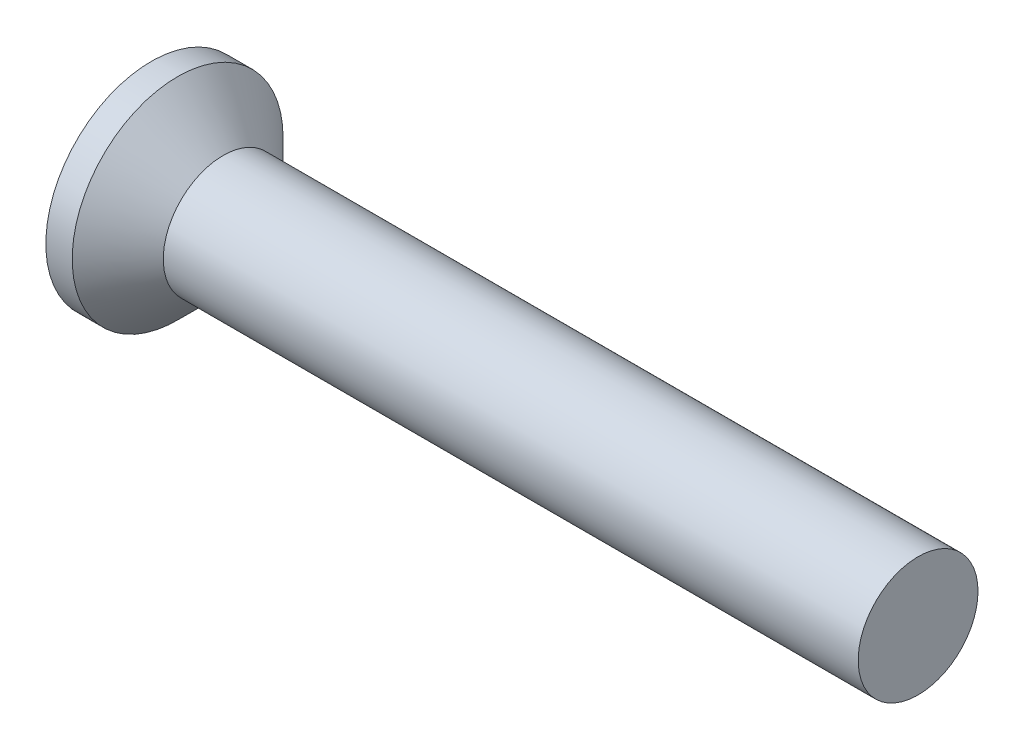
ISO-10303-21;
HEADER;
FILE_DESCRIPTION(('STEP AP214'),'2;1');
FILE_NAME('part.step','',(''),(''),'','','');
FILE_SCHEMA(('AUTOMOTIVE_DESIGN { 1 0 10303 214 1 1 1 1 }'));
ENDSEC;
DATA;
#1=APPLICATION_CONTEXT('core data for automotive mechanical design processes');
#2=APPLICATION_PROTOCOL_DEFINITION('international standard','automotive_design',2000,#1);
#3=PRODUCT_CONTEXT('',#1,'mechanical');
#4=PRODUCT('Part','Part','',(#3));
#5=PRODUCT_RELATED_PRODUCT_CATEGORY('part','',(#4));
#6=PRODUCT_DEFINITION_FORMATION('','',#4);
#7=PRODUCT_DEFINITION_CONTEXT('part definition',#1,'design');
#8=PRODUCT_DEFINITION('design','',#6,#7);
#9=PRODUCT_DEFINITION_SHAPE('','',#8);
#10=(LENGTH_UNIT() NAMED_UNIT(*) SI_UNIT(.MILLI.,.METRE.));
#11=(NAMED_UNIT(*) PLANE_ANGLE_UNIT() SI_UNIT($,.RADIAN.));
#12=(NAMED_UNIT(*) SI_UNIT($,.STERADIAN.) SOLID_ANGLE_UNIT());
#13=UNCERTAINTY_MEASURE_WITH_UNIT(LENGTH_MEASURE(1.E-05),#10,'distance_accuracy_value','');
#14=(GEOMETRIC_REPRESENTATION_CONTEXT(3) GLOBAL_UNCERTAINTY_ASSIGNED_CONTEXT((#13)) GLOBAL_UNIT_ASSIGNED_CONTEXT((#10,
#11,#12)) REPRESENTATION_CONTEXT('',''));
#15=CARTESIAN_POINT('',(0.,0.,0.));
#16=DIRECTION('',(0.,0.,1.));
#17=DIRECTION('',(1.,0.,0.));
#18=AXIS2_PLACEMENT_3D('',#15,#16,#17);
#19=CARTESIAN_POINT('',(0.,2.19999999999999,0.));
#20=DIRECTION('',(-1.,0.,0.));
#21=DIRECTION('',(0.,0.,1.));
#22=AXIS2_PLACEMENT_3D('',#19,#20,#21);
#23=PLANE('',#22);
#24=CARTESIAN_POINT('',(0.,0.,0.));
#25=DIRECTION('',(1.,0.,0.));
#26=DIRECTION('',(0.,0.,-1.));
#27=AXIS2_PLACEMENT_3D('',#24,#25,#26);
#28=CIRCLE('',#27,2.19999999999999);
#29=CARTESIAN_POINT('',(0.,0.,-2.19999999999999));
#30=VERTEX_POINT('',#29);
#31=EDGE_CURVE('E184',#30,#30,#28,.T.);
#32=ORIENTED_EDGE('',*,*,#31,.F.);
#33=EDGE_LOOP('',(#32));
#34=FACE_BOUND('',#33,.T.);
#35=DIRECTION('',(0.,1.,0.));
#36=VECTOR('',#35,1.);
#37=CARTESIAN_POINT('',(0.,-0.29,-0.29));
#38=LINE('',#37,#36);
#39=CARTESIAN_POINT('',(0.,-1.45,-0.29));
#40=VERTEX_POINT('',#39);
#41=CARTESIAN_POINT('',(0.,-0.59,-0.29));
#42=VERTEX_POINT('',#41);
#43=EDGE_CURVE('E288',#40,#42,#38,.T.);
#44=ORIENTED_EDGE('',*,*,#43,.T.);
#45=CARTESIAN_POINT('',(0.,-0.59,-0.59));
#46=DIRECTION('',(-1.,0.,0.));
#47=DIRECTION('',(0.,0.,1.));
#48=AXIS2_PLACEMENT_3D('',#45,#46,#47);
#49=CIRCLE('',#48,0.3);
#50=CARTESIAN_POINT('',(0.,-0.29,-0.59));
#51=VERTEX_POINT('',#50);
#52=EDGE_CURVE('E190',#42,#51,#49,.T.);
#53=ORIENTED_EDGE('',*,*,#52,.T.);
#54=DIRECTION('',(0.,0.,-1.));
#55=VECTOR('',#54,1.);
#56=CARTESIAN_POINT('',(0.,-0.29,-0.29));
#57=LINE('',#56,#55);
#58=CARTESIAN_POINT('',(0.,-0.29,-1.45));
#59=VERTEX_POINT('',#58);
#60=EDGE_CURVE('E283',#51,#59,#57,.T.);
#61=ORIENTED_EDGE('',*,*,#60,.T.);
#62=DIRECTION('',(0.,1.,0.));
#63=VECTOR('',#62,1.);
#64=CARTESIAN_POINT('',(0.,0.29,-1.45));
#65=LINE('',#64,#63);
#66=CARTESIAN_POINT('',(0.,0.29,-1.45));
#67=VERTEX_POINT('',#66);
#68=EDGE_CURVE('E247',#59,#67,#65,.T.);
#69=ORIENTED_EDGE('',*,*,#68,.T.);
#70=DIRECTION('',(0.,0.,1.));
#71=VECTOR('',#70,1.);
#72=CARTESIAN_POINT('',(0.,0.29,-0.29));
#73=LINE('',#72,#71);
#74=CARTESIAN_POINT('',(0.,0.29,-0.59));
#75=VERTEX_POINT('',#74);
#76=EDGE_CURVE('E237',#67,#75,#73,.T.);
#77=ORIENTED_EDGE('',*,*,#76,.T.);
#78=CARTESIAN_POINT('',(0.,0.59,-0.59));
#79=DIRECTION('',(-1.,0.,0.));
#80=DIRECTION('',(0.,0.,1.));
#81=AXIS2_PLACEMENT_3D('',#78,#79,#80);
#82=CIRCLE('',#81,0.3);
#83=CARTESIAN_POINT('',(0.,0.59,-0.29));
#84=VERTEX_POINT('',#83);
#85=EDGE_CURVE('E186',#75,#84,#82,.T.);
#86=ORIENTED_EDGE('',*,*,#85,.T.);
#87=DIRECTION('',(0.,1.,0.));
#88=VECTOR('',#87,1.);
#89=CARTESIAN_POINT('',(0.,0.29,-0.29));
#90=LINE('',#89,#88);
#91=CARTESIAN_POINT('',(0.,1.45,-0.29));
#92=VERTEX_POINT('',#91);
#93=EDGE_CURVE('E234',#84,#92,#90,.T.);
#94=ORIENTED_EDGE('',*,*,#93,.T.);
#95=DIRECTION('',(0.,0.,1.));
#96=VECTOR('',#95,1.);
#97=CARTESIAN_POINT('',(0.,1.45,-0.29));
#98=LINE('',#97,#96);
#99=CARTESIAN_POINT('',(0.,1.45,0.29));
#100=VERTEX_POINT('',#99);
#101=EDGE_CURVE('E243',#92,#100,#98,.T.);
#102=ORIENTED_EDGE('',*,*,#101,.T.);
#103=DIRECTION('',(0.,-1.,0.));
#104=VECTOR('',#103,1.);
#105=CARTESIAN_POINT('',(0.,0.29,0.29));
#106=LINE('',#105,#104);
#107=CARTESIAN_POINT('',(0.,0.59,0.29));
#108=VERTEX_POINT('',#107);
#109=EDGE_CURVE('E245',#100,#108,#106,.T.);
#110=ORIENTED_EDGE('',*,*,#109,.T.);
#111=CARTESIAN_POINT('',(0.,0.59,0.59));
#112=DIRECTION('',(-1.,0.,0.));
#113=DIRECTION('',(0.,0.,1.));
#114=AXIS2_PLACEMENT_3D('',#111,#112,#113);
#115=CIRCLE('',#114,0.3);
#116=CARTESIAN_POINT('',(0.,0.29,0.59));
#117=VERTEX_POINT('',#116);
#118=EDGE_CURVE('E156',#108,#117,#115,.T.);
#119=ORIENTED_EDGE('',*,*,#118,.T.);
#120=DIRECTION('',(0.,0.,1.));
#121=VECTOR('',#120,1.);
#122=CARTESIAN_POINT('',(0.,0.29,0.29));
#123=LINE('',#122,#121);
#124=CARTESIAN_POINT('',(0.,0.29,1.45));
#125=VERTEX_POINT('',#124);
#126=EDGE_CURVE('E150',#117,#125,#123,.T.);
#127=ORIENTED_EDGE('',*,*,#126,.T.);
#128=DIRECTION('',(0.,-1.,0.));
#129=VECTOR('',#128,1.);
#130=CARTESIAN_POINT('',(0.,0.29,1.45));
#131=LINE('',#130,#129);
#132=CARTESIAN_POINT('',(0.,-0.29,1.45));
#133=VERTEX_POINT('',#132);
#134=EDGE_CURVE('E154',#125,#133,#131,.T.);
#135=ORIENTED_EDGE('',*,*,#134,.T.);
#136=DIRECTION('',(0.,0.,-1.));
#137=VECTOR('',#136,1.);
#138=CARTESIAN_POINT('',(0.,-0.29,0.29));
#139=LINE('',#138,#137);
#140=CARTESIAN_POINT('',(0.,-0.29,0.59));
#141=VERTEX_POINT('',#140);
#142=EDGE_CURVE('E166',#133,#141,#139,.T.);
#143=ORIENTED_EDGE('',*,*,#142,.T.);
#144=CARTESIAN_POINT('',(0.,-0.59,0.59));
#145=DIRECTION('',(-1.,0.,0.));
#146=DIRECTION('',(0.,0.,1.));
#147=AXIS2_PLACEMENT_3D('',#144,#145,#146);
#148=CIRCLE('',#147,0.3);
#149=CARTESIAN_POINT('',(0.,-0.59,0.29));
#150=VERTEX_POINT('',#149);
#151=EDGE_CURVE('E188',#141,#150,#148,.T.);
#152=ORIENTED_EDGE('',*,*,#151,.T.);
#153=DIRECTION('',(0.,-1.,0.));
#154=VECTOR('',#153,1.);
#155=CARTESIAN_POINT('',(0.,-0.29,0.29));
#156=LINE('',#155,#154);
#157=CARTESIAN_POINT('',(0.,-1.45,0.289999999999999));
#158=VERTEX_POINT('',#157);
#159=EDGE_CURVE('E295',#150,#158,#156,.T.);
#160=ORIENTED_EDGE('',*,*,#159,.T.);
#161=DIRECTION('',(0.,0.,-1.));
#162=VECTOR('',#161,1.);
#163=CARTESIAN_POINT('',(0.,-1.45,-0.29));
#164=LINE('',#163,#162);
#165=EDGE_CURVE('E292',#158,#40,#164,.T.);
#166=ORIENTED_EDGE('',*,*,#165,.T.);
#167=EDGE_LOOP('',(#44,#53,#61,#69,#77,#86,#94,#102,#110,#119,#127,#135,#143,#152,#160,#166));
#168=FACE_BOUND('',#167,.T.);
#169=ADVANCED_FACE('F38',(#34,#168),#23,.T.);
#170=CARTESIAN_POINT('',(16.,1.25,0.));
#171=DIRECTION('',(1.,0.,0.));
#172=DIRECTION('',(0.,0.,-1.));
#173=AXIS2_PLACEMENT_3D('',#170,#171,#172);
#174=PLANE('',#173);
#175=CARTESIAN_POINT('',(16.,0.,0.));
#176=DIRECTION('',(1.,0.,0.));
#177=DIRECTION('',(0.,0.,-1.));
#178=AXIS2_PLACEMENT_3D('',#175,#176,#177);
#179=CIRCLE('',#178,1.25);
#180=CARTESIAN_POINT('',(16.,0.,-1.25));
#181=VERTEX_POINT('',#180);
#182=EDGE_CURVE('E171',#181,#181,#179,.T.);
#183=ORIENTED_EDGE('',*,*,#182,.T.);
#184=EDGE_LOOP('',(#183));
#185=FACE_BOUND('',#184,.T.);
#186=ADVANCED_FACE('F344',(#185),#174,.T.);
#187=CARTESIAN_POINT('',(4.51581291088132,0.,0.));
#188=DIRECTION('',(1.,0.,0.));
#189=DIRECTION('',(0.,0.,-1.));
#190=AXIS2_PLACEMENT_3D('',#187,#188,#189);
#191=CYLINDRICAL_SURFACE('',#190,2.19999999999999);
#192=ORIENTED_EDGE('',*,*,#31,.T.);
#193=EDGE_LOOP('',(#192));
#194=FACE_BOUND('',#193,.T.);
#195=CARTESIAN_POINT('',(0.550000000000004,0.,0.));
#196=DIRECTION('',(1.,0.,0.));
#197=DIRECTION('',(0.,0.,-1.));
#198=AXIS2_PLACEMENT_3D('',#195,#196,#197);
#199=CIRCLE('',#198,2.19999999999999);
#200=CARTESIAN_POINT('',(0.550000000000004,0.,-2.19999999999999));
#201=VERTEX_POINT('',#200);
#202=EDGE_CURVE('E254',#201,#201,#199,.T.);
#203=ORIENTED_EDGE('',*,*,#202,.F.);
#204=EDGE_LOOP('',(#203));
#205=FACE_BOUND('',#204,.T.);
#206=ADVANCED_FACE('F350',(#194,#205),#191,.T.);
#207=CARTESIAN_POINT('',(1.5,0.,0.));
#208=DIRECTION('',(-1.,0.,0.));
#209=DIRECTION('',(0.,0.,1.));
#210=AXIS2_PLACEMENT_3D('',#207,#208,#209);
#211=CONICAL_SURFACE('',#210,1.24999999999999,0.78539816339745);
#212=ORIENTED_EDGE('',*,*,#202,.T.);
#213=EDGE_LOOP('',(#212));
#214=FACE_BOUND('',#213,.T.);
#215=CARTESIAN_POINT('',(1.5,0.,0.));
#216=DIRECTION('',(1.,0.,0.));
#217=DIRECTION('',(0.,0.,-1.));
#218=AXIS2_PLACEMENT_3D('',#215,#216,#217);
#219=CIRCLE('',#218,1.24999999999999);
#220=CARTESIAN_POINT('',(1.5,0.,-1.24999999999999));
#221=VERTEX_POINT('',#220);
#222=EDGE_CURVE('E174',#221,#221,#219,.T.);
#223=ORIENTED_EDGE('',*,*,#222,.F.);
#224=EDGE_LOOP('',(#223));
#225=FACE_BOUND('',#224,.T.);
#226=ADVANCED_FACE('F490',(#214,#225),#211,.T.);
#227=CARTESIAN_POINT('',(4.51581291088132,0.,0.));
#228=DIRECTION('',(1.,0.,0.));
#229=DIRECTION('',(0.,0.,-1.));
#230=AXIS2_PLACEMENT_3D('',#227,#228,#229);
#231=CYLINDRICAL_SURFACE('',#230,1.25);
#232=ORIENTED_EDGE('',*,*,#182,.F.);
#233=EDGE_LOOP('',(#232));
#234=FACE_BOUND('',#233,.T.);
#235=ORIENTED_EDGE('',*,*,#222,.T.);
#236=EDGE_LOOP('',(#235));
#237=FACE_BOUND('',#236,.T.);
#238=ADVANCED_FACE('F460',(#234,#237),#231,.T.);
#239=CARTESIAN_POINT('',(0.75,0.29,0.29));
#240=DIRECTION('',(0.,-1.,0.));
#241=DIRECTION('',(0.,0.,-1.));
#242=AXIS2_PLACEMENT_3D('',#239,#240,#241);
#243=PLANE('',#242);
#244=ORIENTED_EDGE('',*,*,#126,.F.);
#245=DIRECTION('',(-1.,0.,0.));
#246=VECTOR('',#245,1.);
#247=CARTESIAN_POINT('',(0.75,0.29,0.59));
#248=LINE('',#247,#246);
#249=CARTESIAN_POINT('',(0.75,0.29,0.59));
#250=VERTEX_POINT('',#249);
#251=EDGE_CURVE('E53',#117,#250,#248,.F.);
#252=ORIENTED_EDGE('',*,*,#251,.T.);
#253=DIRECTION('',(0.,0.,1.));
#254=VECTOR('',#253,1.);
#255=CARTESIAN_POINT('',(0.75,0.29,0.29));
#256=LINE('',#255,#254);
#257=CARTESIAN_POINT('',(0.75,0.29,1.01698729810778));
#258=VERTEX_POINT('',#257);
#259=EDGE_CURVE('E169',#250,#258,#256,.T.);
#260=ORIENTED_EDGE('',*,*,#259,.T.);
#261=DIRECTION('',(-0.866025403784438,0.,0.500000000000001));
#262=VECTOR('',#261,1.);
#263=CARTESIAN_POINT('',(0.,0.29,1.45));
#264=LINE('',#263,#262);
#265=EDGE_CURVE('E162',#258,#125,#264,.T.);
#266=ORIENTED_EDGE('',*,*,#265,.T.);
#267=EDGE_LOOP('',(#244,#252,#260,#266));
#268=FACE_BOUND('',#267,.T.);
#269=ADVANCED_FACE('F168',(#268),#243,.T.);
#270=CARTESIAN_POINT('',(0.,0.29,1.45));
#271=DIRECTION('',(-0.500000000000001,0.,-0.866025403784438));
#272=DIRECTION('',(-0.866025403784438,0.,0.500000000000001));
#273=AXIS2_PLACEMENT_3D('',#270,#271,#272);
#274=PLANE('',#273);
#275=ORIENTED_EDGE('',*,*,#134,.F.);
#276=ORIENTED_EDGE('',*,*,#265,.F.);
#277=DIRECTION('',(0.,-1.,0.));
#278=VECTOR('',#277,1.);
#279=CARTESIAN_POINT('',(0.75,0.29,1.01698729810778));
#280=LINE('',#279,#278);
#281=CARTESIAN_POINT('',(0.75,-0.29,1.01698729810778));
#282=VERTEX_POINT('',#281);
#283=EDGE_CURVE('E180',#258,#282,#280,.T.);
#284=ORIENTED_EDGE('',*,*,#283,.T.);
#285=DIRECTION('',(-0.866025403784438,0.,0.500000000000001));
#286=VECTOR('',#285,1.);
#287=CARTESIAN_POINT('',(1.06479473419497,-0.29,0.835240473580834));
#288=LINE('',#287,#286);
#289=EDGE_CURVE('E164',#282,#133,#288,.T.);
#290=ORIENTED_EDGE('',*,*,#289,.T.);
#291=EDGE_LOOP('',(#275,#276,#284,#290));
#292=FACE_BOUND('',#291,.T.);
#293=ADVANCED_FACE('F161',(#292),#274,.T.);
#294=CARTESIAN_POINT('',(0.75,-0.29,0.29));
#295=DIRECTION('',(0.,1.,0.));
#296=DIRECTION('',(0.,0.,1.));
#297=AXIS2_PLACEMENT_3D('',#294,#295,#296);
#298=PLANE('',#297);
#299=DIRECTION('',(0.,0.,-1.));
#300=VECTOR('',#299,1.);
#301=CARTESIAN_POINT('',(0.75,-0.29,0.29));
#302=LINE('',#301,#300);
#303=CARTESIAN_POINT('',(0.75,-0.29,0.59));
#304=VERTEX_POINT('',#303);
#305=EDGE_CURVE('E304',#282,#304,#302,.T.);
#306=ORIENTED_EDGE('',*,*,#305,.T.);
#307=DIRECTION('',(-1.,0.,0.));
#308=VECTOR('',#307,1.);
#309=CARTESIAN_POINT('',(0.75,-0.29,0.59));
#310=LINE('',#309,#308);
#311=EDGE_CURVE('E194',#304,#141,#310,.T.);
#312=ORIENTED_EDGE('',*,*,#311,.T.);
#313=ORIENTED_EDGE('',*,*,#142,.F.);
#314=ORIENTED_EDGE('',*,*,#289,.F.);
#315=EDGE_LOOP('',(#306,#312,#313,#314));
#316=FACE_BOUND('',#315,.T.);
#317=ADVANCED_FACE('F309',(#316),#298,.T.);
#318=CARTESIAN_POINT('',(0.75,-0.29,0.29));
#319=DIRECTION('',(0.,0.,-1.));
#320=DIRECTION('',(0.,1.,0.));
#321=AXIS2_PLACEMENT_3D('',#318,#319,#320);
#322=PLANE('',#321);
#323=ORIENTED_EDGE('',*,*,#159,.F.);
#324=DIRECTION('',(-1.,0.,0.));
#325=VECTOR('',#324,1.);
#326=CARTESIAN_POINT('',(0.75,-0.59,0.29));
#327=LINE('',#326,#325);
#328=CARTESIAN_POINT('',(0.75,-0.59,0.29));
#329=VERTEX_POINT('',#328);
#330=EDGE_CURVE('E197',#150,#329,#327,.F.);
#331=ORIENTED_EDGE('',*,*,#330,.T.);
#332=DIRECTION('',(0.,-1.,0.));
#333=VECTOR('',#332,1.);
#334=CARTESIAN_POINT('',(0.75,-0.29,0.29));
#335=LINE('',#334,#333);
#336=CARTESIAN_POINT('',(0.75,-1.01698729810778,0.289999999999999));
#337=VERTEX_POINT('',#336);
#338=EDGE_CURVE('E265',#329,#337,#335,.T.);
#339=ORIENTED_EDGE('',*,*,#338,.T.);
#340=DIRECTION('',(-0.866025403784438,-0.500000000000001,0.));
#341=VECTOR('',#340,1.);
#342=CARTESIAN_POINT('',(0.,-1.45,0.289999999999999));
#343=LINE('',#342,#341);
#344=EDGE_CURVE('E176',#337,#158,#343,.T.);
#345=ORIENTED_EDGE('',*,*,#344,.T.);
#346=EDGE_LOOP('',(#323,#331,#339,#345));
#347=FACE_BOUND('',#346,.T.);
#348=ADVANCED_FACE('F319',(#347),#322,.T.);
#349=CARTESIAN_POINT('',(0.,-1.45,-0.29));
#350=DIRECTION('',(-0.500000000000001,0.866025403784438,0.));
#351=DIRECTION('',(-0.866025403784438,-0.500000000000001,0.));
#352=AXIS2_PLACEMENT_3D('',#349,#350,#351);
#353=PLANE('',#352);
#354=ORIENTED_EDGE('',*,*,#165,.F.);
#355=ORIENTED_EDGE('',*,*,#344,.F.);
#356=DIRECTION('',(0.,0.,-1.));
#357=VECTOR('',#356,1.);
#358=CARTESIAN_POINT('',(0.75,-1.01698729810778,-0.29));
#359=LINE('',#358,#357);
#360=CARTESIAN_POINT('',(0.75,-1.01698729810778,-0.29));
#361=VERTEX_POINT('',#360);
#362=EDGE_CURVE('E262',#337,#361,#359,.T.);
#363=ORIENTED_EDGE('',*,*,#362,.T.);
#364=DIRECTION('',(-0.866025403784438,-0.500000000000001,0.));
#365=VECTOR('',#364,1.);
#366=CARTESIAN_POINT('',(1.06479473419497,-0.835240473580834,-0.29));
#367=LINE('',#366,#365);
#368=EDGE_CURVE('E259',#361,#40,#367,.T.);
#369=ORIENTED_EDGE('',*,*,#368,.T.);
#370=EDGE_LOOP('',(#354,#355,#363,#369));
#371=FACE_BOUND('',#370,.T.);
#372=ADVANCED_FACE('F323',(#371),#353,.T.);
#373=CARTESIAN_POINT('',(0.75,-0.29,-0.29));
#374=DIRECTION('',(0.,0.,1.));
#375=DIRECTION('',(1.,0.,0.));
#376=AXIS2_PLACEMENT_3D('',#373,#374,#375);
#377=PLANE('',#376);
#378=DIRECTION('',(0.,1.,0.));
#379=VECTOR('',#378,1.);
#380=CARTESIAN_POINT('',(0.75,-0.29,-0.29));
#381=LINE('',#380,#379);
#382=CARTESIAN_POINT('',(0.75,-0.59,-0.29));
#383=VERTEX_POINT('',#382);
#384=EDGE_CURVE('E264',#361,#383,#381,.T.);
#385=ORIENTED_EDGE('',*,*,#384,.T.);
#386=DIRECTION('',(-1.,0.,0.));
#387=VECTOR('',#386,1.);
#388=CARTESIAN_POINT('',(0.75,-0.59,-0.29));
#389=LINE('',#388,#387);
#390=EDGE_CURVE('E181',#383,#42,#389,.T.);
#391=ORIENTED_EDGE('',*,*,#390,.T.);
#392=ORIENTED_EDGE('',*,*,#43,.F.);
#393=ORIENTED_EDGE('',*,*,#368,.F.);
#394=EDGE_LOOP('',(#385,#391,#392,#393));
#395=FACE_BOUND('',#394,.T.);
#396=ADVANCED_FACE('F327',(#395),#377,.T.);
#397=CARTESIAN_POINT('',(0.75,-0.29,-0.29));
#398=DIRECTION('',(0.,1.,0.));
#399=DIRECTION('',(0.,0.,1.));
#400=AXIS2_PLACEMENT_3D('',#397,#398,#399);
#401=PLANE('',#400);
#402=ORIENTED_EDGE('',*,*,#60,.F.);
#403=DIRECTION('',(-1.,0.,0.));
#404=VECTOR('',#403,1.);
#405=CARTESIAN_POINT('',(0.75,-0.29,-0.59));
#406=LINE('',#405,#404);
#407=CARTESIAN_POINT('',(0.75,-0.29,-0.59));
#408=VERTEX_POINT('',#407);
#409=EDGE_CURVE('E192',#51,#408,#406,.F.);
#410=ORIENTED_EDGE('',*,*,#409,.T.);
#411=DIRECTION('',(0.,0.,-1.));
#412=VECTOR('',#411,1.);
#413=CARTESIAN_POINT('',(0.75,-0.29,-0.29));
#414=LINE('',#413,#412);
#415=CARTESIAN_POINT('',(0.75,-0.29,-1.01698729810778));
#416=VERTEX_POINT('',#415);
#417=EDGE_CURVE('E276',#408,#416,#414,.T.);
#418=ORIENTED_EDGE('',*,*,#417,.T.);
#419=DIRECTION('',(-0.866025403784438,0.,-0.500000000000001));
#420=VECTOR('',#419,1.);
#421=CARTESIAN_POINT('',(0.,-0.29,-1.45));
#422=LINE('',#421,#420);
#423=EDGE_CURVE('E261',#416,#59,#422,.T.);
#424=ORIENTED_EDGE('',*,*,#423,.T.);
#425=EDGE_LOOP('',(#402,#410,#418,#424));
#426=FACE_BOUND('',#425,.T.);
#427=ADVANCED_FACE('F282',(#426),#401,.T.);
#428=CARTESIAN_POINT('',(0.,0.29,-1.45));
#429=DIRECTION('',(-0.500000000000001,0.,0.866025403784438));
#430=DIRECTION('',(0.866025403784438,0.,0.500000000000001));
#431=AXIS2_PLACEMENT_3D('',#428,#429,#430);
#432=PLANE('',#431);
#433=ORIENTED_EDGE('',*,*,#68,.F.);
#434=ORIENTED_EDGE('',*,*,#423,.F.);
#435=DIRECTION('',(0.,1.,0.));
#436=VECTOR('',#435,1.);
#437=CARTESIAN_POINT('',(0.75,0.29,-1.01698729810778));
#438=LINE('',#437,#436);
#439=CARTESIAN_POINT('',(0.75,0.29,-1.01698729810778));
#440=VERTEX_POINT('',#439);
#441=EDGE_CURVE('E229',#416,#440,#438,.T.);
#442=ORIENTED_EDGE('',*,*,#441,.T.);
#443=DIRECTION('',(-0.866025403784438,0.,-0.500000000000001));
#444=VECTOR('',#443,1.);
#445=CARTESIAN_POINT('',(1.06479473419497,0.29,-0.835240473580835));
#446=LINE('',#445,#444);
#447=EDGE_CURVE('E228',#440,#67,#446,.T.);
#448=ORIENTED_EDGE('',*,*,#447,.T.);
#449=EDGE_LOOP('',(#433,#434,#442,#448));
#450=FACE_BOUND('',#449,.T.);
#451=ADVANCED_FACE('F287',(#450),#432,.T.);
#452=CARTESIAN_POINT('',(0.75,0.29,-0.29));
#453=DIRECTION('',(0.,-1.,0.));
#454=DIRECTION('',(0.,0.,-1.));
#455=AXIS2_PLACEMENT_3D('',#452,#453,#454);
#456=PLANE('',#455);
#457=DIRECTION('',(0.,0.,1.));
#458=VECTOR('',#457,1.);
#459=CARTESIAN_POINT('',(0.75,0.29,-0.29));
#460=LINE('',#459,#458);
#461=CARTESIAN_POINT('',(0.75,0.29,-0.59));
#462=VERTEX_POINT('',#461);
#463=EDGE_CURVE('E217',#440,#462,#460,.T.);
#464=ORIENTED_EDGE('',*,*,#463,.T.);
#465=DIRECTION('',(-1.,0.,0.));
#466=VECTOR('',#465,1.);
#467=CARTESIAN_POINT('',(0.75,0.29,-0.59));
#468=LINE('',#467,#466);
#469=EDGE_CURVE('E199',#462,#75,#468,.T.);
#470=ORIENTED_EDGE('',*,*,#469,.T.);
#471=ORIENTED_EDGE('',*,*,#76,.F.);
#472=ORIENTED_EDGE('',*,*,#447,.F.);
#473=EDGE_LOOP('',(#464,#470,#471,#472));
#474=FACE_BOUND('',#473,.T.);
#475=ADVANCED_FACE('F225',(#474),#456,.T.);
#476=CARTESIAN_POINT('',(0.75,0.29,-0.29));
#477=DIRECTION('',(0.,0.,1.));
#478=DIRECTION('',(1.,0.,0.));
#479=AXIS2_PLACEMENT_3D('',#476,#477,#478);
#480=PLANE('',#479);
#481=ORIENTED_EDGE('',*,*,#93,.F.);
#482=DIRECTION('',(-1.,0.,0.));
#483=VECTOR('',#482,1.);
#484=CARTESIAN_POINT('',(0.75,0.59,-0.29));
#485=LINE('',#484,#483);
#486=CARTESIAN_POINT('',(0.75,0.59,-0.29));
#487=VERTEX_POINT('',#486);
#488=EDGE_CURVE('E202',#84,#487,#485,.F.);
#489=ORIENTED_EDGE('',*,*,#488,.T.);
#490=DIRECTION('',(0.,1.,0.));
#491=VECTOR('',#490,1.);
#492=CARTESIAN_POINT('',(0.75,0.29,-0.29));
#493=LINE('',#492,#491);
#494=CARTESIAN_POINT('',(0.75,1.01698729810778,-0.29));
#495=VERTEX_POINT('',#494);
#496=EDGE_CURVE('E219',#487,#495,#493,.T.);
#497=ORIENTED_EDGE('',*,*,#496,.T.);
#498=DIRECTION('',(-0.866025403784438,0.500000000000001,0.));
#499=VECTOR('',#498,1.);
#500=CARTESIAN_POINT('',(0.,1.45,-0.29));
#501=LINE('',#500,#499);
#502=EDGE_CURVE('E241',#495,#92,#501,.T.);
#503=ORIENTED_EDGE('',*,*,#502,.T.);
#504=EDGE_LOOP('',(#481,#489,#497,#503));
#505=FACE_BOUND('',#504,.T.);
#506=ADVANCED_FACE('F239',(#505),#480,.T.);
#507=CARTESIAN_POINT('',(0.,1.45,-0.29));
#508=DIRECTION('',(-0.500000000000001,-0.866025403784438,0.));
#509=DIRECTION('',(0.866025403784438,-0.500000000000001,0.));
#510=AXIS2_PLACEMENT_3D('',#507,#508,#509);
#511=PLANE('',#510);
#512=ORIENTED_EDGE('',*,*,#101,.F.);
#513=ORIENTED_EDGE('',*,*,#502,.F.);
#514=DIRECTION('',(0.,0.,1.));
#515=VECTOR('',#514,1.);
#516=CARTESIAN_POINT('',(0.75,1.01698729810778,-0.29));
#517=LINE('',#516,#515);
#518=CARTESIAN_POINT('',(0.75,1.01698729810778,0.29));
#519=VERTEX_POINT('',#518);
#520=EDGE_CURVE('E271',#495,#519,#517,.T.);
#521=ORIENTED_EDGE('',*,*,#520,.T.);
#522=DIRECTION('',(-0.866025403784438,0.500000000000001,0.));
#523=VECTOR('',#522,1.);
#524=CARTESIAN_POINT('',(1.06479473419497,0.835240473580834,0.29));
#525=LINE('',#524,#523);
#526=EDGE_CURVE('E268',#519,#100,#525,.T.);
#527=ORIENTED_EDGE('',*,*,#526,.T.);
#528=EDGE_LOOP('',(#512,#513,#521,#527));
#529=FACE_BOUND('',#528,.T.);
#530=ADVANCED_FACE('F362',(#529),#511,.T.);
#531=CARTESIAN_POINT('',(0.75,0.29,0.29));
#532=DIRECTION('',(0.,0.,-1.));
#533=DIRECTION('',(0.,1.,0.));
#534=AXIS2_PLACEMENT_3D('',#531,#532,#533);
#535=PLANE('',#534);
#536=DIRECTION('',(0.,-1.,0.));
#537=VECTOR('',#536,1.);
#538=CARTESIAN_POINT('',(0.75,0.29,0.29));
#539=LINE('',#538,#537);
#540=CARTESIAN_POINT('',(0.75,0.59,0.29));
#541=VERTEX_POINT('',#540);
#542=EDGE_CURVE('E270',#519,#541,#539,.T.);
#543=ORIENTED_EDGE('',*,*,#542,.T.);
#544=DIRECTION('',(-1.,0.,0.));
#545=VECTOR('',#544,1.);
#546=CARTESIAN_POINT('',(0.75,0.59,0.29));
#547=LINE('',#546,#545);
#548=EDGE_CURVE('E204',#541,#108,#547,.T.);
#549=ORIENTED_EDGE('',*,*,#548,.T.);
#550=ORIENTED_EDGE('',*,*,#109,.F.);
#551=ORIENTED_EDGE('',*,*,#526,.F.);
#552=EDGE_LOOP('',(#543,#549,#550,#551));
#553=FACE_BOUND('',#552,.T.);
#554=ADVANCED_FACE('F340',(#553),#535,.T.);
#555=CARTESIAN_POINT('',(0.75,0.29,0.29));
#556=DIRECTION('',(1.,0.,0.));
#557=DIRECTION('',(0.,0.,-1.));
#558=AXIS2_PLACEMENT_3D('',#555,#556,#557);
#559=PLANE('',#558);
#560=ORIENTED_EDGE('',*,*,#259,.F.);
#561=CARTESIAN_POINT('',(0.75,0.59,0.59));
#562=DIRECTION('',(1.,0.,0.));
#563=DIRECTION('',(0.,0.,-1.));
#564=AXIS2_PLACEMENT_3D('',#561,#562,#563);
#565=CIRCLE('',#564,0.3);
#566=EDGE_CURVE('E11',#250,#541,#565,.T.);
#567=ORIENTED_EDGE('',*,*,#566,.T.);
#568=ORIENTED_EDGE('',*,*,#542,.F.);
#569=ORIENTED_EDGE('',*,*,#520,.F.);
#570=ORIENTED_EDGE('',*,*,#496,.F.);
#571=CARTESIAN_POINT('',(0.75,0.59,-0.59));
#572=DIRECTION('',(1.,0.,0.));
#573=DIRECTION('',(0.,0.,-1.));
#574=AXIS2_PLACEMENT_3D('',#571,#572,#573);
#575=CIRCLE('',#574,0.3);
#576=EDGE_CURVE('E46',#487,#462,#575,.T.);
#577=ORIENTED_EDGE('',*,*,#576,.T.);
#578=ORIENTED_EDGE('',*,*,#463,.F.);
#579=ORIENTED_EDGE('',*,*,#441,.F.);
#580=ORIENTED_EDGE('',*,*,#417,.F.);
#581=CARTESIAN_POINT('',(0.75,-0.59,-0.59));
#582=DIRECTION('',(1.,0.,0.));
#583=DIRECTION('',(0.,0.,-1.));
#584=AXIS2_PLACEMENT_3D('',#581,#582,#583);
#585=CIRCLE('',#584,0.3);
#586=EDGE_CURVE('E208',#408,#383,#585,.T.);
#587=ORIENTED_EDGE('',*,*,#586,.T.);
#588=ORIENTED_EDGE('',*,*,#384,.F.);
#589=ORIENTED_EDGE('',*,*,#362,.F.);
#590=ORIENTED_EDGE('',*,*,#338,.F.);
#591=CARTESIAN_POINT('',(0.75,-0.59,0.59));
#592=DIRECTION('',(1.,0.,0.));
#593=DIRECTION('',(0.,0.,-1.));
#594=AXIS2_PLACEMENT_3D('',#591,#592,#593);
#595=CIRCLE('',#594,0.3);
#596=EDGE_CURVE('E210',#329,#304,#595,.T.);
#597=ORIENTED_EDGE('',*,*,#596,.T.);
#598=ORIENTED_EDGE('',*,*,#305,.F.);
#599=ORIENTED_EDGE('',*,*,#283,.F.);
#600=EDGE_LOOP('',(#560,#567,#568,#569,#570,#577,#578,#579,#580,#587,#588,#589,#590,#597,#598,#599));
#601=FACE_BOUND('',#600,.T.);
#602=ADVANCED_FACE('F215',(#601),#559,.F.);
#603=CARTESIAN_POINT('',(0.75,-0.59,-0.59));
#604=DIRECTION('',(-1.,0.,0.));
#605=DIRECTION('',(0.,0.,1.));
#606=AXIS2_PLACEMENT_3D('',#603,#604,#605);
#607=CYLINDRICAL_SURFACE('',#606,0.3);
#608=ORIENTED_EDGE('',*,*,#586,.F.);
#609=ORIENTED_EDGE('',*,*,#409,.F.);
#610=ORIENTED_EDGE('',*,*,#52,.F.);
#611=ORIENTED_EDGE('',*,*,#390,.F.);
#612=EDGE_LOOP('',(#608,#609,#610,#611));
#613=FACE_BOUND('',#612,.T.);
#614=ADVANCED_FACE('F332',(#613),#607,.T.);
#615=CARTESIAN_POINT('',(0.75,-0.59,0.59));
#616=DIRECTION('',(-1.,0.,0.));
#617=DIRECTION('',(0.,0.,1.));
#618=AXIS2_PLACEMENT_3D('',#615,#616,#617);
#619=CYLINDRICAL_SURFACE('',#618,0.3);
#620=ORIENTED_EDGE('',*,*,#596,.F.);
#621=ORIENTED_EDGE('',*,*,#330,.F.);
#622=ORIENTED_EDGE('',*,*,#151,.F.);
#623=ORIENTED_EDGE('',*,*,#311,.F.);
#624=EDGE_LOOP('',(#620,#621,#622,#623));
#625=FACE_BOUND('',#624,.T.);
#626=ADVANCED_FACE('F316',(#625),#619,.T.);
#627=CARTESIAN_POINT('',(0.75,0.59,-0.59));
#628=DIRECTION('',(-1.,0.,0.));
#629=DIRECTION('',(0.,0.,1.));
#630=AXIS2_PLACEMENT_3D('',#627,#628,#629);
#631=CYLINDRICAL_SURFACE('',#630,0.3);
#632=ORIENTED_EDGE('',*,*,#576,.F.);
#633=ORIENTED_EDGE('',*,*,#488,.F.);
#634=ORIENTED_EDGE('',*,*,#85,.F.);
#635=ORIENTED_EDGE('',*,*,#469,.F.);
#636=EDGE_LOOP('',(#632,#633,#634,#635));
#637=FACE_BOUND('',#636,.T.);
#638=ADVANCED_FACE('F231',(#637),#631,.T.);
#639=CARTESIAN_POINT('',(0.75,0.59,0.59));
#640=DIRECTION('',(-1.,0.,0.));
#641=DIRECTION('',(0.,0.,1.));
#642=AXIS2_PLACEMENT_3D('',#639,#640,#641);
#643=CYLINDRICAL_SURFACE('',#642,0.3);
#644=ORIENTED_EDGE('',*,*,#566,.F.);
#645=ORIENTED_EDGE('',*,*,#251,.F.);
#646=ORIENTED_EDGE('',*,*,#118,.F.);
#647=ORIENTED_EDGE('',*,*,#548,.F.);
#648=EDGE_LOOP('',(#644,#645,#646,#647));
#649=FACE_BOUND('',#648,.T.);
#650=ADVANCED_FACE('F40',(#649),#643,.T.);
#651=CLOSED_SHELL('',(#169,#186,#206,#226,#238,#269,#293,#317,#348,#372,#396,#427,#451,#475,
#506,#530,#554,#602,#614,#626,#638,#650));
#652=MANIFOLD_SOLID_BREP('B2',#651);
#653=ADVANCED_BREP_SHAPE_REPRESENTATION('',(#18,#652),#14);
#654=SHAPE_DEFINITION_REPRESENTATION(#9,#653);
ENDSEC;
END-ISO-10303-21;
